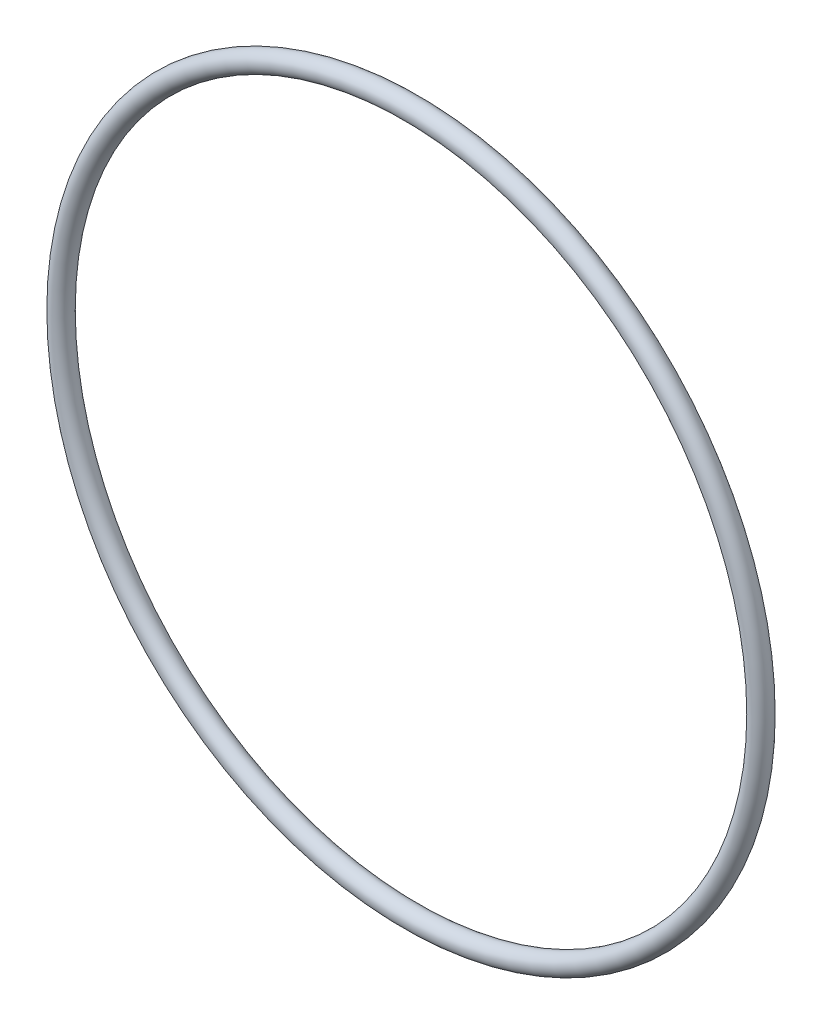
ISO-10303-21;
HEADER;
FILE_DESCRIPTION(('STEP AP214'),'2;1');
FILE_NAME('part.step','',(''),(''),'','','');
FILE_SCHEMA(('AUTOMOTIVE_DESIGN { 1 0 10303 214 1 1 1 1 }'));
ENDSEC;
DATA;
#1=APPLICATION_CONTEXT('core data for automotive mechanical design processes');
#2=APPLICATION_PROTOCOL_DEFINITION('international standard','automotive_design',2000,#1);
#3=PRODUCT_CONTEXT('',#1,'mechanical');
#4=PRODUCT('Part','Part','',(#3));
#5=PRODUCT_RELATED_PRODUCT_CATEGORY('part','',(#4));
#6=PRODUCT_DEFINITION_FORMATION('','',#4);
#7=PRODUCT_DEFINITION_CONTEXT('part definition',#1,'design');
#8=PRODUCT_DEFINITION('design','',#6,#7);
#9=PRODUCT_DEFINITION_SHAPE('','',#8);
#10=(LENGTH_UNIT() NAMED_UNIT(*) SI_UNIT(.MILLI.,.METRE.));
#11=(NAMED_UNIT(*) PLANE_ANGLE_UNIT() SI_UNIT($,.RADIAN.));
#12=(NAMED_UNIT(*) SI_UNIT($,.STERADIAN.) SOLID_ANGLE_UNIT());
#13=UNCERTAINTY_MEASURE_WITH_UNIT(LENGTH_MEASURE(1.E-05),#10,'distance_accuracy_value','');
#14=(GEOMETRIC_REPRESENTATION_CONTEXT(3) GLOBAL_UNCERTAINTY_ASSIGNED_CONTEXT((#13)) GLOBAL_UNIT_ASSIGNED_CONTEXT((#10,
#11,#12)) REPRESENTATION_CONTEXT('',''));
#15=CARTESIAN_POINT('',(0.,0.,0.));
#16=DIRECTION('',(0.,0.,1.));
#17=DIRECTION('',(1.,0.,0.));
#18=AXIS2_PLACEMENT_3D('',#15,#16,#17);
#19=CARTESIAN_POINT('',(0.,0.,0.));
#20=DIRECTION('',(0.,0.,1.));
#21=DIRECTION('',(1.,0.,0.));
#22=AXIS2_PLACEMENT_3D('',#19,#20,#21);
#23=TOROIDAL_SURFACE('',#22,55.245,1.5875);
#24=CARTESIAN_POINT('',(55.245,0.,0.));
#25=DIRECTION('',(0.,1.,0.));
#26=DIRECTION('',(-1.,0.,0.));
#27=AXIS2_PLACEMENT_3D('',#24,#25,#26);
#28=CIRCLE('',#27,1.5875);
#29=CARTESIAN_POINT('',(56.8325,0.,0.));
#30=VERTEX_POINT('',#29);
#31=EDGE_CURVE('E11',#30,#30,#28,.T.);
#32=CARTESIAN_POINT('',(0.,0.,0.));
#33=DIRECTION('',(0.,0.,1.));
#34=DIRECTION('',(1.,0.,0.));
#35=AXIS2_PLACEMENT_3D('',#32,#33,#34);
#36=CIRCLE('',#35,56.8325);
#37=EDGE_CURVE('',#30,#30,#36,.T.);
#38=ORIENTED_EDGE('',*,*,#31,.T.);
#39=ORIENTED_EDGE('',*,*,#31,.F.);
#40=ORIENTED_EDGE('',*,*,#37,.T.);
#41=ORIENTED_EDGE('',*,*,#37,.F.);
#42=EDGE_LOOP('',(#38,#40,#39,#41));
#43=FACE_BOUND('',#42,.T.);
#44=ADVANCED_FACE('F49',(#43),#23,.T.);
#45=CLOSED_SHELL('',(#44));
#46=MANIFOLD_SOLID_BREP('B2',#45);
#47=ADVANCED_BREP_SHAPE_REPRESENTATION('',(#18,#46),#14);
#48=SHAPE_DEFINITION_REPRESENTATION(#9,#47);
ENDSEC;
END-ISO-10303-21;
